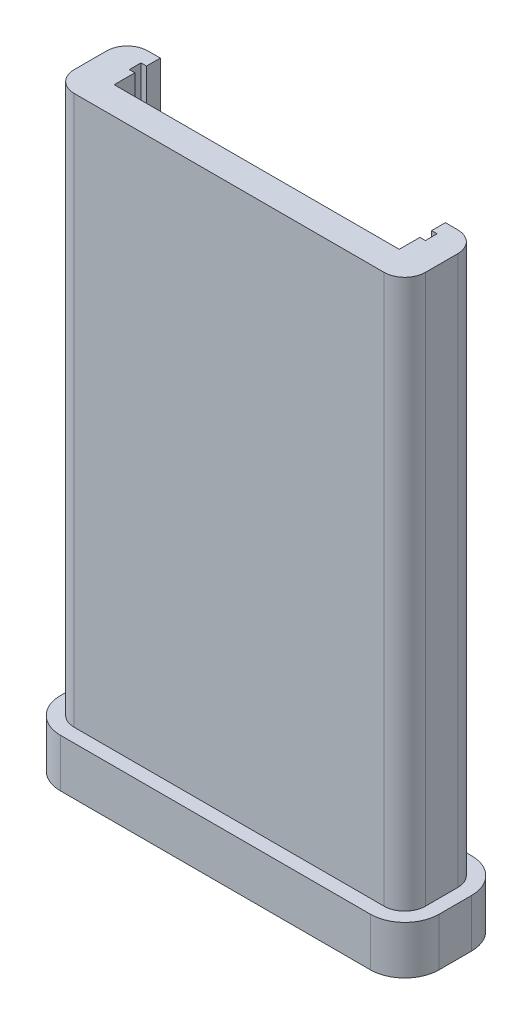
ISO-10303-21;
HEADER;
FILE_DESCRIPTION(('STEP AP214'),'2;1');
FILE_NAME('part.step','',(''),(''),'','','');
FILE_SCHEMA(('AUTOMOTIVE_DESIGN { 1 0 10303 214 1 1 1 1 }'));
ENDSEC;
DATA;
#1=APPLICATION_CONTEXT('core data for automotive mechanical design processes');
#2=APPLICATION_PROTOCOL_DEFINITION('international standard','automotive_design',2000,#1);
#3=PRODUCT_CONTEXT('',#1,'mechanical');
#4=PRODUCT('Part','Part','',(#3));
#5=PRODUCT_RELATED_PRODUCT_CATEGORY('part','',(#4));
#6=PRODUCT_DEFINITION_FORMATION('','',#4);
#7=PRODUCT_DEFINITION_CONTEXT('part definition',#1,'design');
#8=PRODUCT_DEFINITION('design','',#6,#7);
#9=PRODUCT_DEFINITION_SHAPE('','',#8);
#10=(LENGTH_UNIT() NAMED_UNIT(*) SI_UNIT(.MILLI.,.METRE.));
#11=(NAMED_UNIT(*) PLANE_ANGLE_UNIT() SI_UNIT($,.RADIAN.));
#12=(NAMED_UNIT(*) SI_UNIT($,.STERADIAN.) SOLID_ANGLE_UNIT());
#13=UNCERTAINTY_MEASURE_WITH_UNIT(LENGTH_MEASURE(1.E-05),#10,'distance_accuracy_value','');
#14=(GEOMETRIC_REPRESENTATION_CONTEXT(3) GLOBAL_UNCERTAINTY_ASSIGNED_CONTEXT((#13)) GLOBAL_UNIT_ASSIGNED_CONTEXT((#10,
#11,#12)) REPRESENTATION_CONTEXT('',''));
#15=CARTESIAN_POINT('',(0.,0.,0.));
#16=DIRECTION('',(0.,0.,1.));
#17=DIRECTION('',(1.,0.,0.));
#18=AXIS2_PLACEMENT_3D('',#15,#16,#17);
#19=CARTESIAN_POINT('',(0.,107.5944,-13.589));
#20=DIRECTION('',(0.,0.,-1.));
#21=DIRECTION('',(-1.,0.,0.));
#22=AXIS2_PLACEMENT_3D('',#19,#20,#21);
#23=PLANE('',#22);
#24=DIRECTION('',(-1.,0.,0.));
#25=VECTOR('',#24,1.);
#26=CARTESIAN_POINT('',(0.,6.34999999999999,-13.589));
#27=LINE('',#26,#25);
#28=CARTESIAN_POINT('',(71.755,6.34999999999999,-13.589));
#29=VERTEX_POINT('',#28);
#30=CARTESIAN_POINT('',(70.739,6.34999999999999,-13.589));
#31=VERTEX_POINT('',#30);
#32=EDGE_CURVE('E270',#29,#31,#27,.T.);
#33=ORIENTED_EDGE('',*,*,#32,.F.);
#34=DIRECTION('',(0.,-1.,0.));
#35=VECTOR('',#34,1.);
#36=CARTESIAN_POINT('',(71.755,107.5944,-13.589));
#37=LINE('',#36,#35);
#38=CARTESIAN_POINT('',(71.755,107.5944,-13.589));
#39=VERTEX_POINT('',#38);
#40=EDGE_CURVE('E372',#39,#29,#37,.T.);
#41=ORIENTED_EDGE('',*,*,#40,.F.);
#42=DIRECTION('',(1.,0.,0.));
#43=VECTOR('',#42,1.);
#44=CARTESIAN_POINT('',(0.,107.5944,-13.589));
#45=LINE('',#44,#43);
#46=CARTESIAN_POINT('',(70.739,107.5944,-13.589));
#47=VERTEX_POINT('',#46);
#48=EDGE_CURVE('E306',#47,#39,#45,.T.);
#49=ORIENTED_EDGE('',*,*,#48,.F.);
#50=DIRECTION('',(0.,-1.,0.));
#51=VECTOR('',#50,1.);
#52=CARTESIAN_POINT('',(70.739,107.5944,-13.589));
#53=LINE('',#52,#51);
#54=EDGE_CURVE('E339',#47,#31,#53,.T.);
#55=ORIENTED_EDGE('',*,*,#54,.T.);
#56=EDGE_LOOP('',(#33,#41,#49,#55));
#57=FACE_BOUND('',#56,.T.);
#58=ADVANCED_FACE('F39',(#57),#23,.F.);
#59=CARTESIAN_POINT('',(71.7550000000001,107.5944,-4.6123235949501E-13));
#60=DIRECTION('',(1.,0.,0.));
#61=DIRECTION('',(0.,0.,-1.));
#62=AXIS2_PLACEMENT_3D('',#59,#60,#61);
#63=PLANE('',#62);
#64=DIRECTION('',(0.,0.,-1.));
#65=VECTOR('',#64,1.);
#66=CARTESIAN_POINT('',(71.7550000000001,6.34999999999999,-4.6123235949501E-13));
#67=LINE('',#66,#65);
#68=CARTESIAN_POINT('',(71.755,6.34999999999999,-11.43));
#69=VERTEX_POINT('',#68);
#70=EDGE_CURVE('E277',#69,#29,#67,.T.);
#71=ORIENTED_EDGE('',*,*,#70,.F.);
#72=DIRECTION('',(0.,-1.,0.));
#73=VECTOR('',#72,1.);
#74=CARTESIAN_POINT('',(71.755,107.5944,-11.43));
#75=LINE('',#74,#73);
#76=CARTESIAN_POINT('',(71.755,107.5944,-11.43));
#77=VERTEX_POINT('',#76);
#78=EDGE_CURVE('E369',#77,#69,#75,.T.);
#79=ORIENTED_EDGE('',*,*,#78,.F.);
#80=DIRECTION('',(0.,0.,1.));
#81=VECTOR('',#80,1.);
#82=CARTESIAN_POINT('',(71.7550000000001,107.5944,-4.6123235949501E-13));
#83=LINE('',#82,#81);
#84=EDGE_CURVE('E309',#39,#77,#83,.T.);
#85=ORIENTED_EDGE('',*,*,#84,.F.);
#86=ORIENTED_EDGE('',*,*,#40,.T.);
#87=EDGE_LOOP('',(#71,#79,#85,#86));
#88=FACE_BOUND('',#87,.T.);
#89=ADVANCED_FACE('F469',(#88),#63,.F.);
#90=CARTESIAN_POINT('',(0.,107.5944,-11.43));
#91=DIRECTION('',(0.,0.,-1.));
#92=DIRECTION('',(-1.,0.,0.));
#93=AXIS2_PLACEMENT_3D('',#90,#91,#92);
#94=PLANE('',#93);
#95=ORIENTED_EDGE('',*,*,#78,.T.);
#96=DIRECTION('',(-1.,0.,0.));
#97=VECTOR('',#96,1.);
#98=CARTESIAN_POINT('',(0.,6.34999999999999,-11.43));
#99=LINE('',#98,#97);
#100=CARTESIAN_POINT('',(70.739,6.34999999999999,-11.43));
#101=VERTEX_POINT('',#100);
#102=EDGE_CURVE('E303',#69,#101,#99,.T.);
#103=ORIENTED_EDGE('',*,*,#102,.T.);
#104=DIRECTION('',(0.,-1.,0.));
#105=VECTOR('',#104,1.);
#106=CARTESIAN_POINT('',(70.739,107.5944,-11.43));
#107=LINE('',#106,#105);
#108=CARTESIAN_POINT('',(70.739,107.5944,-11.43));
#109=VERTEX_POINT('',#108);
#110=EDGE_CURVE('E366',#109,#101,#107,.T.);
#111=ORIENTED_EDGE('',*,*,#110,.F.);
#112=DIRECTION('',(1.,0.,0.));
#113=VECTOR('',#112,1.);
#114=CARTESIAN_POINT('',(0.,107.5944,-11.43));
#115=LINE('',#114,#113);
#116=EDGE_CURVE('E312',#109,#77,#115,.T.);
#117=ORIENTED_EDGE('',*,*,#116,.T.);
#118=EDGE_LOOP('',(#95,#103,#111,#117));
#119=FACE_BOUND('',#118,.T.);
#120=ADVANCED_FACE('F465',(#119),#94,.T.);
#121=CARTESIAN_POINT('',(70.739,107.5944,-1.1537205685004E-13));
#122=DIRECTION('',(-1.,0.,0.));
#123=DIRECTION('',(0.,0.,1.));
#124=AXIS2_PLACEMENT_3D('',#121,#122,#123);
#125=PLANE('',#124);
#126=ORIENTED_EDGE('',*,*,#110,.T.);
#127=DIRECTION('',(0.,0.,1.));
#128=VECTOR('',#127,1.);
#129=CARTESIAN_POINT('',(70.739,6.34999999999999,-1.1537205685004E-13));
#130=LINE('',#129,#128);
#131=CARTESIAN_POINT('',(70.739,6.34999999999999,-7.62));
#132=VERTEX_POINT('',#131);
#133=EDGE_CURVE('E300',#101,#132,#130,.T.);
#134=ORIENTED_EDGE('',*,*,#133,.T.);
#135=DIRECTION('',(0.,-1.,0.));
#136=VECTOR('',#135,1.);
#137=CARTESIAN_POINT('',(70.739,107.5944,-7.62));
#138=LINE('',#137,#136);
#139=CARTESIAN_POINT('',(70.739,107.5944,-7.62));
#140=VERTEX_POINT('',#139);
#141=EDGE_CURVE('E363',#140,#132,#138,.T.);
#142=ORIENTED_EDGE('',*,*,#141,.F.);
#143=DIRECTION('',(0.,0.,-1.));
#144=VECTOR('',#143,1.);
#145=CARTESIAN_POINT('',(70.739,107.5944,-1.1537205685004E-13));
#146=LINE('',#145,#144);
#147=EDGE_CURVE('E315',#140,#109,#146,.T.);
#148=ORIENTED_EDGE('',*,*,#147,.T.);
#149=EDGE_LOOP('',(#126,#134,#142,#148));
#150=FACE_BOUND('',#149,.T.);
#151=ADVANCED_FACE('F460',(#150),#125,.T.);
#152=CARTESIAN_POINT('',(0.,107.5944,-7.62));
#153=DIRECTION('',(0.,0.,-1.));
#154=DIRECTION('',(-1.,0.,0.));
#155=AXIS2_PLACEMENT_3D('',#152,#153,#154);
#156=PLANE('',#155);
#157=ORIENTED_EDGE('',*,*,#141,.T.);
#158=DIRECTION('',(-1.,0.,0.));
#159=VECTOR('',#158,1.);
#160=CARTESIAN_POINT('',(0.,6.34999999999999,-7.62));
#161=LINE('',#160,#159);
#162=CARTESIAN_POINT('',(18.161,6.34999999999999,-7.62));
#163=VERTEX_POINT('',#162);
#164=EDGE_CURVE('E297',#132,#163,#161,.T.);
#165=ORIENTED_EDGE('',*,*,#164,.T.);
#166=DIRECTION('',(0.,-1.,0.));
#167=VECTOR('',#166,1.);
#168=CARTESIAN_POINT('',(18.161,107.5944,-7.62));
#169=LINE('',#168,#167);
#170=CARTESIAN_POINT('',(18.161,107.5944,-7.62));
#171=VERTEX_POINT('',#170);
#172=EDGE_CURVE('E360',#171,#163,#169,.T.);
#173=ORIENTED_EDGE('',*,*,#172,.F.);
#174=DIRECTION('',(1.,0.,0.));
#175=VECTOR('',#174,1.);
#176=CARTESIAN_POINT('',(0.,107.5944,-7.62));
#177=LINE('',#176,#175);
#178=EDGE_CURVE('E319',#171,#140,#177,.T.);
#179=ORIENTED_EDGE('',*,*,#178,.T.);
#180=EDGE_LOOP('',(#157,#165,#173,#179));
#181=FACE_BOUND('',#180,.T.);
#182=ADVANCED_FACE('F457',(#181),#156,.T.);
#183=CARTESIAN_POINT('',(18.161,107.5944,0.));
#184=DIRECTION('',(-1.,0.,0.));
#185=DIRECTION('',(0.,0.,1.));
#186=AXIS2_PLACEMENT_3D('',#183,#184,#185);
#187=PLANE('',#186);
#188=DIRECTION('',(0.,0.,1.));
#189=VECTOR('',#188,1.);
#190=CARTESIAN_POINT('',(18.161,6.34999999999999,0.));
#191=LINE('',#190,#189);
#192=CARTESIAN_POINT('',(18.161,6.34999999999999,-11.43));
#193=VERTEX_POINT('',#192);
#194=EDGE_CURVE('E295',#193,#163,#191,.T.);
#195=ORIENTED_EDGE('',*,*,#194,.F.);
#196=DIRECTION('',(0.,-1.,0.));
#197=VECTOR('',#196,1.);
#198=CARTESIAN_POINT('',(18.161,107.5944,-11.43));
#199=LINE('',#198,#197);
#200=CARTESIAN_POINT('',(18.161,107.5944,-11.43));
#201=VERTEX_POINT('',#200);
#202=EDGE_CURVE('E357',#201,#193,#199,.T.);
#203=ORIENTED_EDGE('',*,*,#202,.F.);
#204=DIRECTION('',(0.,0.,-1.));
#205=VECTOR('',#204,1.);
#206=CARTESIAN_POINT('',(18.161,107.5944,0.));
#207=LINE('',#206,#205);
#208=EDGE_CURVE('E323',#171,#201,#207,.T.);
#209=ORIENTED_EDGE('',*,*,#208,.F.);
#210=ORIENTED_EDGE('',*,*,#172,.T.);
#211=EDGE_LOOP('',(#195,#203,#209,#210));
#212=FACE_BOUND('',#211,.T.);
#213=ADVANCED_FACE('F454',(#212),#187,.F.);
#214=ORIENTED_EDGE('',*,*,#202,.T.);
#215=DIRECTION('',(-1.,0.,0.));
#216=VECTOR('',#215,1.);
#217=CARTESIAN_POINT('',(0.,6.34999999999999,-11.43));
#218=LINE('',#217,#216);
#219=CARTESIAN_POINT('',(17.145,6.34999999999999,-11.43));
#220=VERTEX_POINT('',#219);
#221=EDGE_CURVE('E292',#193,#220,#218,.T.);
#222=ORIENTED_EDGE('',*,*,#221,.T.);
#223=DIRECTION('',(0.,-1.,0.));
#224=VECTOR('',#223,1.);
#225=CARTESIAN_POINT('',(17.145,107.5944,-11.43));
#226=LINE('',#225,#224);
#227=CARTESIAN_POINT('',(17.145,107.5944,-11.43));
#228=VERTEX_POINT('',#227);
#229=EDGE_CURVE('E354',#228,#220,#226,.T.);
#230=ORIENTED_EDGE('',*,*,#229,.F.);
#231=EDGE_CURVE('E316',#228,#201,#115,.T.);
#232=ORIENTED_EDGE('',*,*,#231,.T.);
#233=EDGE_LOOP('',(#214,#222,#230,#232));
#234=FACE_BOUND('',#233,.T.);
#235=ADVANCED_FACE('F448',(#234),#94,.T.);
#236=CARTESIAN_POINT('',(17.145,107.5944,0.));
#237=DIRECTION('',(1.,0.,0.));
#238=DIRECTION('',(0.,0.,-1.));
#239=AXIS2_PLACEMENT_3D('',#236,#237,#238);
#240=PLANE('',#239);
#241=ORIENTED_EDGE('',*,*,#229,.T.);
#242=DIRECTION('',(0.,0.,-1.));
#243=VECTOR('',#242,1.);
#244=CARTESIAN_POINT('',(17.145,6.34999999999999,0.));
#245=LINE('',#244,#243);
#246=CARTESIAN_POINT('',(17.145,6.34999999999999,-13.589));
#247=VERTEX_POINT('',#246);
#248=EDGE_CURVE('E289',#220,#247,#245,.T.);
#249=ORIENTED_EDGE('',*,*,#248,.T.);
#250=DIRECTION('',(0.,-1.,0.));
#251=VECTOR('',#250,1.);
#252=CARTESIAN_POINT('',(17.145,107.5944,-13.589));
#253=LINE('',#252,#251);
#254=CARTESIAN_POINT('',(17.145,107.5944,-13.589));
#255=VERTEX_POINT('',#254);
#256=EDGE_CURVE('E351',#255,#247,#253,.T.);
#257=ORIENTED_EDGE('',*,*,#256,.F.);
#258=DIRECTION('',(0.,0.,1.));
#259=VECTOR('',#258,1.);
#260=CARTESIAN_POINT('',(17.145,107.5944,0.));
#261=LINE('',#260,#259);
#262=EDGE_CURVE('E326',#255,#228,#261,.T.);
#263=ORIENTED_EDGE('',*,*,#262,.T.);
#264=EDGE_LOOP('',(#241,#249,#257,#263));
#265=FACE_BOUND('',#264,.T.);
#266=ADVANCED_FACE('F445',(#265),#240,.T.);
#267=DIRECTION('',(-1.,0.,0.));
#268=VECTOR('',#267,1.);
#269=CARTESIAN_POINT('',(0.,6.34999999999999,-13.589));
#270=LINE('',#269,#268);
#271=CARTESIAN_POINT('',(18.161,6.34999999999999,-13.589));
#272=VERTEX_POINT('',#271);
#273=EDGE_CURVE('E287',#272,#247,#270,.T.);
#274=ORIENTED_EDGE('',*,*,#273,.F.);
#275=DIRECTION('',(0.,-1.,0.));
#276=VECTOR('',#275,1.);
#277=CARTESIAN_POINT('',(18.161,107.5944,-13.589));
#278=LINE('',#277,#276);
#279=CARTESIAN_POINT('',(18.161,107.5944,-13.589));
#280=VERTEX_POINT('',#279);
#281=EDGE_CURVE('E348',#280,#272,#278,.T.);
#282=ORIENTED_EDGE('',*,*,#281,.F.);
#283=EDGE_CURVE('E310',#255,#280,#45,.T.);
#284=ORIENTED_EDGE('',*,*,#283,.F.);
#285=ORIENTED_EDGE('',*,*,#256,.T.);
#286=EDGE_LOOP('',(#274,#282,#284,#285));
#287=FACE_BOUND('',#286,.T.);
#288=ADVANCED_FACE('F441',(#287),#23,.F.);
#289=DIRECTION('',(0.,0.,1.));
#290=VECTOR('',#289,1.);
#291=CARTESIAN_POINT('',(18.161,6.34999999999999,0.));
#292=LINE('',#291,#290);
#293=CARTESIAN_POINT('',(18.161,6.34999999999999,-16.129));
#294=VERTEX_POINT('',#293);
#295=EDGE_CURVE('E285',#294,#272,#292,.T.);
#296=ORIENTED_EDGE('',*,*,#295,.F.);
#297=DIRECTION('',(0.,-1.,0.));
#298=VECTOR('',#297,1.);
#299=CARTESIAN_POINT('',(18.161,107.5944,-16.129));
#300=LINE('',#299,#298);
#301=CARTESIAN_POINT('',(18.161,107.5944,-16.129));
#302=VERTEX_POINT('',#301);
#303=EDGE_CURVE('E345',#302,#294,#300,.T.);
#304=ORIENTED_EDGE('',*,*,#303,.F.);
#305=EDGE_CURVE('E325',#280,#302,#207,.T.);
#306=ORIENTED_EDGE('',*,*,#305,.F.);
#307=ORIENTED_EDGE('',*,*,#281,.T.);
#308=EDGE_LOOP('',(#296,#304,#306,#307));
#309=FACE_BOUND('',#308,.T.);
#310=ADVANCED_FACE('F437',(#309),#187,.F.);
#311=CARTESIAN_POINT('',(0.,107.5944,-16.129));
#312=DIRECTION('',(0.,0.,-1.));
#313=DIRECTION('',(-1.,0.,0.));
#314=AXIS2_PLACEMENT_3D('',#311,#312,#313);
#315=PLANE('',#314);
#316=ORIENTED_EDGE('',*,*,#303,.T.);
#317=DIRECTION('',(-1.,0.,0.));
#318=VECTOR('',#317,1.);
#319=CARTESIAN_POINT('',(0.,6.34999999999999,-16.129));
#320=LINE('',#319,#318);
#321=CARTESIAN_POINT('',(15.875,6.34999999999999,-16.129));
#322=VERTEX_POINT('',#321);
#323=EDGE_CURVE('E282',#294,#322,#320,.T.);
#324=ORIENTED_EDGE('',*,*,#323,.T.);
#325=DIRECTION('',(0.,-1.,0.));
#326=VECTOR('',#325,1.);
#327=CARTESIAN_POINT('',(15.875,107.5944,-16.129));
#328=LINE('',#327,#326);
#329=CARTESIAN_POINT('',(15.875,107.5944,-16.129));
#330=VERTEX_POINT('',#329);
#331=EDGE_CURVE('E391',#322,#330,#328,.F.);
#332=ORIENTED_EDGE('',*,*,#331,.T.);
#333=DIRECTION('',(1.,0.,0.));
#334=VECTOR('',#333,1.);
#335=CARTESIAN_POINT('',(0.,107.5944,-16.129));
#336=LINE('',#335,#334);
#337=EDGE_CURVE('E329',#330,#302,#336,.T.);
#338=ORIENTED_EDGE('',*,*,#337,.T.);
#339=EDGE_LOOP('',(#316,#324,#332,#338));
#340=FACE_BOUND('',#339,.T.);
#341=ADVANCED_FACE('F431',(#340),#315,.T.);
#342=CARTESIAN_POINT('',(12.065,107.5944,0.));
#343=DIRECTION('',(1.,0.,0.));
#344=DIRECTION('',(0.,0.,-1.));
#345=AXIS2_PLACEMENT_3D('',#342,#343,#344);
#346=PLANE('',#345);
#347=DIRECTION('',(0.,0.,-1.));
#348=VECTOR('',#347,1.);
#349=CARTESIAN_POINT('',(12.065,6.34999999999999,0.));
#350=LINE('',#349,#348);
#351=CARTESIAN_POINT('',(12.065,6.34999999999999,-6.35));
#352=VERTEX_POINT('',#351);
#353=CARTESIAN_POINT('',(12.065,6.34999999999999,-12.319));
#354=VERTEX_POINT('',#353);
#355=EDGE_CURVE('E275',#352,#354,#350,.T.);
#356=ORIENTED_EDGE('',*,*,#355,.F.);
#357=DIRECTION('',(0.,-1.,0.));
#358=VECTOR('',#357,1.);
#359=CARTESIAN_POINT('',(12.065,107.5944,-6.35));
#360=LINE('',#359,#358);
#361=CARTESIAN_POINT('',(12.065,107.5944,-6.35));
#362=VERTEX_POINT('',#361);
#363=EDGE_CURVE('E383',#352,#362,#360,.F.);
#364=ORIENTED_EDGE('',*,*,#363,.T.);
#365=DIRECTION('',(0.,0.,1.));
#366=VECTOR('',#365,1.);
#367=CARTESIAN_POINT('',(12.065,107.5944,0.));
#368=LINE('',#367,#366);
#369=CARTESIAN_POINT('',(12.065,107.5944,-12.319));
#370=VERTEX_POINT('',#369);
#371=EDGE_CURVE('E331',#370,#362,#368,.T.);
#372=ORIENTED_EDGE('',*,*,#371,.F.);
#373=DIRECTION('',(0.,-1.,0.));
#374=VECTOR('',#373,1.);
#375=CARTESIAN_POINT('',(12.065,5.9944,-12.319));
#376=LINE('',#375,#374);
#377=EDGE_CURVE('E380',#370,#354,#376,.T.);
#378=ORIENTED_EDGE('',*,*,#377,.T.);
#379=EDGE_LOOP('',(#356,#364,#372,#378));
#380=FACE_BOUND('',#379,.T.);
#381=ADVANCED_FACE('F422',(#380),#346,.F.);
#382=CARTESIAN_POINT('',(0.,107.5944,-2.54));
#383=DIRECTION('',(0.,0.,-1.));
#384=DIRECTION('',(-1.,0.,0.));
#385=AXIS2_PLACEMENT_3D('',#382,#383,#384);
#386=PLANE('',#385);
#387=DIRECTION('',(-1.,0.,0.));
#388=VECTOR('',#387,1.);
#389=CARTESIAN_POINT('',(0.,6.34999999999999,-2.54));
#390=LINE('',#389,#388);
#391=CARTESIAN_POINT('',(73.025,6.34999999999999,-2.54));
#392=VERTEX_POINT('',#391);
#393=CARTESIAN_POINT('',(15.875,6.34999999999999,-2.54));
#394=VERTEX_POINT('',#393);
#395=EDGE_CURVE('E268',#392,#394,#390,.T.);
#396=ORIENTED_EDGE('',*,*,#395,.F.);
#397=DIRECTION('',(0.,-1.,0.));
#398=VECTOR('',#397,1.);
#399=CARTESIAN_POINT('',(73.025,107.5944,-2.54));
#400=LINE('',#399,#398);
#401=CARTESIAN_POINT('',(73.025,107.5944,-2.54));
#402=VERTEX_POINT('',#401);
#403=EDGE_CURVE('E375',#392,#402,#400,.F.);
#404=ORIENTED_EDGE('',*,*,#403,.T.);
#405=DIRECTION('',(1.,0.,0.));
#406=VECTOR('',#405,1.);
#407=CARTESIAN_POINT('',(0.,107.5944,-2.54));
#408=LINE('',#407,#406);
#409=CARTESIAN_POINT('',(15.875,107.5944,-2.54));
#410=VERTEX_POINT('',#409);
#411=EDGE_CURVE('E335',#410,#402,#408,.T.);
#412=ORIENTED_EDGE('',*,*,#411,.F.);
#413=DIRECTION('',(0.,-1.,0.));
#414=VECTOR('',#413,1.);
#415=CARTESIAN_POINT('',(15.875,107.5944,-2.54));
#416=LINE('',#415,#414);
#417=EDGE_CURVE('E377',#410,#394,#416,.T.);
#418=ORIENTED_EDGE('',*,*,#417,.T.);
#419=EDGE_LOOP('',(#396,#404,#412,#418));
#420=FACE_BOUND('',#419,.T.);
#421=ADVANCED_FACE('F413',(#420),#386,.F.);
#422=CARTESIAN_POINT('',(76.835,107.5944,0.));
#423=DIRECTION('',(1.,0.,0.));
#424=DIRECTION('',(0.,0.,-1.));
#425=AXIS2_PLACEMENT_3D('',#422,#423,#424);
#426=PLANE('',#425);
#427=DIRECTION('',(0.,-1.,0.));
#428=VECTOR('',#427,1.);
#429=CARTESIAN_POINT('',(76.835,5.9944,-6.35));
#430=LINE('',#429,#428);
#431=CARTESIAN_POINT('',(76.835,107.5944,-6.35));
#432=VERTEX_POINT('',#431);
#433=CARTESIAN_POINT('',(76.835,6.34999999999999,-6.35));
#434=VERTEX_POINT('',#433);
#435=EDGE_CURVE('E395',#432,#434,#430,.T.);
#436=ORIENTED_EDGE('',*,*,#435,.T.);
#437=DIRECTION('',(0.,0.,-1.));
#438=VECTOR('',#437,1.);
#439=CARTESIAN_POINT('',(76.835,6.34999999999999,0.));
#440=LINE('',#439,#438);
#441=CARTESIAN_POINT('',(76.835,6.34999999999999,-12.319));
#442=VERTEX_POINT('',#441);
#443=EDGE_CURVE('E254',#434,#442,#440,.T.);
#444=ORIENTED_EDGE('',*,*,#443,.T.);
#445=DIRECTION('',(0.,-1.,0.));
#446=VECTOR('',#445,1.);
#447=CARTESIAN_POINT('',(76.835,107.5944,-12.319));
#448=LINE('',#447,#446);
#449=CARTESIAN_POINT('',(76.835,107.5944,-12.319));
#450=VERTEX_POINT('',#449);
#451=EDGE_CURVE('E393',#442,#450,#448,.F.);
#452=ORIENTED_EDGE('',*,*,#451,.T.);
#453=DIRECTION('',(0.,0.,1.));
#454=VECTOR('',#453,1.);
#455=CARTESIAN_POINT('',(76.835,107.5944,0.));
#456=LINE('',#455,#454);
#457=EDGE_CURVE('E337',#450,#432,#456,.T.);
#458=ORIENTED_EDGE('',*,*,#457,.T.);
#459=EDGE_LOOP('',(#436,#444,#452,#458));
#460=FACE_BOUND('',#459,.T.);
#461=ADVANCED_FACE('F406',(#460),#426,.T.);
#462=DIRECTION('',(0.,-1.,0.));
#463=VECTOR('',#462,1.);
#464=CARTESIAN_POINT('',(73.025,107.5944,-16.129));
#465=LINE('',#464,#463);
#466=CARTESIAN_POINT('',(73.025,107.5944,-16.129));
#467=VERTEX_POINT('',#466);
#468=CARTESIAN_POINT('',(73.025,6.34999999999999,-16.129));
#469=VERTEX_POINT('',#468);
#470=EDGE_CURVE('E47',#467,#469,#465,.T.);
#471=ORIENTED_EDGE('',*,*,#470,.T.);
#472=DIRECTION('',(-1.,0.,0.));
#473=VECTOR('',#472,1.);
#474=CARTESIAN_POINT('',(0.,6.34999999999999,-16.129));
#475=LINE('',#474,#473);
#476=CARTESIAN_POINT('',(70.739,6.34999999999999,-16.129));
#477=VERTEX_POINT('',#476);
#478=EDGE_CURVE('E251',#469,#477,#475,.T.);
#479=ORIENTED_EDGE('',*,*,#478,.T.);
#480=DIRECTION('',(0.,-1.,0.));
#481=VECTOR('',#480,1.);
#482=CARTESIAN_POINT('',(70.739,107.5944,-16.129));
#483=LINE('',#482,#481);
#484=CARTESIAN_POINT('',(70.739,107.5944,-16.129));
#485=VERTEX_POINT('',#484);
#486=EDGE_CURVE('E342',#485,#477,#483,.T.);
#487=ORIENTED_EDGE('',*,*,#486,.F.);
#488=EDGE_CURVE('E332',#485,#467,#336,.T.);
#489=ORIENTED_EDGE('',*,*,#488,.T.);
#490=EDGE_LOOP('',(#471,#479,#487,#489));
#491=FACE_BOUND('',#490,.T.);
#492=ADVANCED_FACE('F400',(#491),#315,.T.);
#493=ORIENTED_EDGE('',*,*,#486,.T.);
#494=DIRECTION('',(0.,0.,1.));
#495=VECTOR('',#494,1.);
#496=CARTESIAN_POINT('',(70.739,6.34999999999999,-1.1537205685004E-13));
#497=LINE('',#496,#495);
#498=EDGE_CURVE('E265',#477,#31,#497,.T.);
#499=ORIENTED_EDGE('',*,*,#498,.T.);
#500=ORIENTED_EDGE('',*,*,#54,.F.);
#501=EDGE_CURVE('E320',#47,#485,#146,.T.);
#502=ORIENTED_EDGE('',*,*,#501,.T.);
#503=EDGE_LOOP('',(#493,#499,#500,#502));
#504=FACE_BOUND('',#503,.T.);
#505=ADVANCED_FACE('F475',(#504),#125,.T.);
#506=CARTESIAN_POINT('',(15.875,107.5944,-6.35));
#507=DIRECTION('',(0.,-1.,0.));
#508=DIRECTION('',(0.,0.,-1.));
#509=AXIS2_PLACEMENT_3D('',#506,#507,#508);
#510=CYLINDRICAL_SURFACE('',#509,3.81);
#511=ORIENTED_EDGE('',*,*,#363,.F.);
#512=CARTESIAN_POINT('',(15.875,6.34999999999999,-6.35));
#513=DIRECTION('',(0.,-1.,0.));
#514=DIRECTION('',(0.,0.,-1.));
#515=AXIS2_PLACEMENT_3D('',#512,#513,#514);
#516=CIRCLE('',#515,3.81);
#517=EDGE_CURVE('E272',#352,#394,#516,.F.);
#518=ORIENTED_EDGE('',*,*,#517,.T.);
#519=ORIENTED_EDGE('',*,*,#417,.F.);
#520=CARTESIAN_POINT('',(15.875,107.5944,-6.35));
#521=DIRECTION('',(0.,1.,0.));
#522=DIRECTION('',(0.,0.,1.));
#523=AXIS2_PLACEMENT_3D('',#520,#521,#522);
#524=CIRCLE('',#523,3.81);
#525=EDGE_CURVE('E389',#362,#410,#524,.T.);
#526=ORIENTED_EDGE('',*,*,#525,.F.);
#527=EDGE_LOOP('',(#511,#518,#519,#526));
#528=FACE_BOUND('',#527,.T.);
#529=ADVANCED_FACE('F419',(#528),#510,.T.);
#530=CARTESIAN_POINT('',(15.875,107.5944,-12.319));
#531=DIRECTION('',(0.,1.,0.));
#532=DIRECTION('',(0.,0.,1.));
#533=AXIS2_PLACEMENT_3D('',#530,#531,#532);
#534=CYLINDRICAL_SURFACE('',#533,3.81);
#535=ORIENTED_EDGE('',*,*,#331,.F.);
#536=CARTESIAN_POINT('',(15.875,6.34999999999999,-12.319));
#537=DIRECTION('',(0.,-1.,0.));
#538=DIRECTION('',(0.,0.,-1.));
#539=AXIS2_PLACEMENT_3D('',#536,#537,#538);
#540=CIRCLE('',#539,3.81);
#541=EDGE_CURVE('E279',#322,#354,#540,.F.);
#542=ORIENTED_EDGE('',*,*,#541,.T.);
#543=ORIENTED_EDGE('',*,*,#377,.F.);
#544=CARTESIAN_POINT('',(15.875,107.5944,-12.319));
#545=DIRECTION('',(0.,1.,0.));
#546=DIRECTION('',(0.,0.,1.));
#547=AXIS2_PLACEMENT_3D('',#544,#545,#546);
#548=CIRCLE('',#547,3.81);
#549=EDGE_CURVE('E387',#330,#370,#548,.T.);
#550=ORIENTED_EDGE('',*,*,#549,.F.);
#551=EDGE_LOOP('',(#535,#542,#543,#550));
#552=FACE_BOUND('',#551,.T.);
#553=ADVANCED_FACE('F428',(#552),#534,.T.);
#554=CARTESIAN_POINT('',(73.025,107.5944,-6.35));
#555=DIRECTION('',(0.,1.,0.));
#556=DIRECTION('',(0.,0.,1.));
#557=AXIS2_PLACEMENT_3D('',#554,#555,#556);
#558=CYLINDRICAL_SURFACE('',#557,3.81);
#559=ORIENTED_EDGE('',*,*,#403,.F.);
#560=CARTESIAN_POINT('',(73.025,6.34999999999999,-6.35));
#561=DIRECTION('',(0.,-1.,0.));
#562=DIRECTION('',(0.,0.,-1.));
#563=AXIS2_PLACEMENT_3D('',#560,#561,#562);
#564=CIRCLE('',#563,3.81);
#565=EDGE_CURVE('E262',#392,#434,#564,.F.);
#566=ORIENTED_EDGE('',*,*,#565,.T.);
#567=ORIENTED_EDGE('',*,*,#435,.F.);
#568=CARTESIAN_POINT('',(73.025,107.5944,-6.35));
#569=DIRECTION('',(0.,1.,0.));
#570=DIRECTION('',(0.,0.,1.));
#571=AXIS2_PLACEMENT_3D('',#568,#569,#570);
#572=CIRCLE('',#571,3.81);
#573=EDGE_CURVE('E60',#402,#432,#572,.T.);
#574=ORIENTED_EDGE('',*,*,#573,.F.);
#575=EDGE_LOOP('',(#559,#566,#567,#574));
#576=FACE_BOUND('',#575,.T.);
#577=ADVANCED_FACE('F410',(#576),#558,.T.);
#578=CARTESIAN_POINT('',(73.025,107.5944,-12.319));
#579=DIRECTION('',(0.,-1.,0.));
#580=DIRECTION('',(0.,0.,-1.));
#581=AXIS2_PLACEMENT_3D('',#578,#579,#580);
#582=CYLINDRICAL_SURFACE('',#581,3.81);
#583=ORIENTED_EDGE('',*,*,#451,.F.);
#584=CARTESIAN_POINT('',(73.025,6.34999999999999,-12.319));
#585=DIRECTION('',(0.,-1.,0.));
#586=DIRECTION('',(0.,0.,-1.));
#587=AXIS2_PLACEMENT_3D('',#584,#585,#586);
#588=CIRCLE('',#587,3.81);
#589=EDGE_CURVE('E11',#442,#469,#588,.F.);
#590=ORIENTED_EDGE('',*,*,#589,.T.);
#591=ORIENTED_EDGE('',*,*,#470,.F.);
#592=CARTESIAN_POINT('',(73.025,107.5944,-12.319));
#593=DIRECTION('',(0.,1.,0.));
#594=DIRECTION('',(0.,0.,1.));
#595=AXIS2_PLACEMENT_3D('',#592,#593,#594);
#596=CIRCLE('',#595,3.81);
#597=EDGE_CURVE('E54',#450,#467,#596,.T.);
#598=ORIENTED_EDGE('',*,*,#597,.F.);
#599=EDGE_LOOP('',(#583,#590,#591,#598));
#600=FACE_BOUND('',#599,.T.);
#601=ADVANCED_FACE('F41',(#600),#582,.T.);
#602=CARTESIAN_POINT('',(0.,107.5944,0.));
#603=DIRECTION('',(0.,1.,0.));
#604=DIRECTION('',(0.,0.,1.));
#605=AXIS2_PLACEMENT_3D('',#602,#603,#604);
#606=PLANE('',#605);
#607=ORIENTED_EDGE('',*,*,#371,.T.);
#608=ORIENTED_EDGE('',*,*,#525,.T.);
#609=ORIENTED_EDGE('',*,*,#411,.T.);
#610=ORIENTED_EDGE('',*,*,#573,.T.);
#611=ORIENTED_EDGE('',*,*,#457,.F.);
#612=ORIENTED_EDGE('',*,*,#597,.T.);
#613=ORIENTED_EDGE('',*,*,#488,.F.);
#614=ORIENTED_EDGE('',*,*,#501,.F.);
#615=ORIENTED_EDGE('',*,*,#48,.T.);
#616=ORIENTED_EDGE('',*,*,#84,.T.);
#617=ORIENTED_EDGE('',*,*,#116,.F.);
#618=ORIENTED_EDGE('',*,*,#147,.F.);
#619=ORIENTED_EDGE('',*,*,#178,.F.);
#620=ORIENTED_EDGE('',*,*,#208,.T.);
#621=ORIENTED_EDGE('',*,*,#231,.F.);
#622=ORIENTED_EDGE('',*,*,#262,.F.);
#623=ORIENTED_EDGE('',*,*,#283,.T.);
#624=ORIENTED_EDGE('',*,*,#305,.T.);
#625=ORIENTED_EDGE('',*,*,#337,.F.);
#626=ORIENTED_EDGE('',*,*,#549,.T.);
#627=EDGE_LOOP('',(#607,#608,#609,#610,#611,#612,#613,#614,#615,#616,#617,#618,#619,#620,#621,
#622,#623,#624,#625,#626));
#628=FACE_BOUND('',#627,.T.);
#629=ADVANCED_FACE('F462',(#628),#606,.T.);
#630=CARTESIAN_POINT('',(0.,6.35,0.));
#631=DIRECTION('',(0.,-1.,0.));
#632=DIRECTION('',(0.,0.,-1.));
#633=AXIS2_PLACEMENT_3D('',#630,#631,#632);
#634=PLANE('',#633);
#635=DIRECTION('',(0.,0.,-1.));
#636=VECTOR('',#635,1.);
#637=CARTESIAN_POINT('',(9.525,6.35,0.));
#638=LINE('',#637,#636);
#639=CARTESIAN_POINT('',(9.525,6.35,-6.35));
#640=VERTEX_POINT('',#639);
#641=CARTESIAN_POINT('',(9.525,6.35,-12.319));
#642=VERTEX_POINT('',#641);
#643=EDGE_CURVE('E250',#640,#642,#638,.T.);
#644=ORIENTED_EDGE('',*,*,#643,.F.);
#645=CARTESIAN_POINT('',(15.875,6.35,-6.35));
#646=DIRECTION('',(0.,-1.,0.));
#647=DIRECTION('',(0.,0.,-1.));
#648=AXIS2_PLACEMENT_3D('',#645,#646,#647);
#649=CIRCLE('',#648,6.34999999999999);
#650=CARTESIAN_POINT('',(15.875,6.35,0.));
#651=VERTEX_POINT('',#650);
#652=EDGE_CURVE('E246',#651,#640,#649,.T.);
#653=ORIENTED_EDGE('',*,*,#652,.F.);
#654=DIRECTION('',(-1.,0.,0.));
#655=VECTOR('',#654,1.);
#656=CARTESIAN_POINT('',(0.,6.35,0.));
#657=LINE('',#656,#655);
#658=CARTESIAN_POINT('',(73.025,6.35,0.));
#659=VERTEX_POINT('',#658);
#660=EDGE_CURVE('E606',#659,#651,#657,.T.);
#661=ORIENTED_EDGE('',*,*,#660,.F.);
#662=CARTESIAN_POINT('',(73.025,6.35,-6.35));
#663=DIRECTION('',(0.,-1.,0.));
#664=DIRECTION('',(0.,0.,-1.));
#665=AXIS2_PLACEMENT_3D('',#662,#663,#664);
#666=CIRCLE('',#665,6.35);
#667=CARTESIAN_POINT('',(79.375,6.35,-6.35));
#668=VERTEX_POINT('',#667);
#669=EDGE_CURVE('E604',#668,#659,#666,.T.);
#670=ORIENTED_EDGE('',*,*,#669,.F.);
#671=DIRECTION('',(0.,0.,1.));
#672=VECTOR('',#671,1.);
#673=CARTESIAN_POINT('',(79.375,6.35,0.));
#674=LINE('',#673,#672);
#675=CARTESIAN_POINT('',(79.375,6.35,-12.319));
#676=VERTEX_POINT('',#675);
#677=EDGE_CURVE('E602',#676,#668,#674,.T.);
#678=ORIENTED_EDGE('',*,*,#677,.F.);
#679=CARTESIAN_POINT('',(73.025,6.35,-12.319));
#680=DIRECTION('',(0.,-1.,0.));
#681=DIRECTION('',(0.,0.,-1.));
#682=AXIS2_PLACEMENT_3D('',#679,#680,#681);
#683=CIRCLE('',#682,6.35);
#684=CARTESIAN_POINT('',(73.025,6.35,-18.669));
#685=VERTEX_POINT('',#684);
#686=EDGE_CURVE('E600',#685,#676,#683,.T.);
#687=ORIENTED_EDGE('',*,*,#686,.F.);
#688=DIRECTION('',(1.,0.,0.));
#689=VECTOR('',#688,1.);
#690=CARTESIAN_POINT('',(0.,6.35,-18.669));
#691=LINE('',#690,#689);
#692=CARTESIAN_POINT('',(15.875,6.35,-18.669));
#693=VERTEX_POINT('',#692);
#694=EDGE_CURVE('E598',#693,#685,#691,.T.);
#695=ORIENTED_EDGE('',*,*,#694,.F.);
#696=CARTESIAN_POINT('',(15.875,6.35,-12.319));
#697=DIRECTION('',(0.,-1.,0.));
#698=DIRECTION('',(0.,0.,-1.));
#699=AXIS2_PLACEMENT_3D('',#696,#697,#698);
#700=CIRCLE('',#699,6.35);
#701=EDGE_CURVE('E575',#642,#693,#700,.T.);
#702=ORIENTED_EDGE('',*,*,#701,.F.);
#703=EDGE_LOOP('',(#644,#653,#661,#670,#678,#687,#695,#702));
#704=FACE_BOUND('',#703,.T.);
#705=ORIENTED_EDGE('',*,*,#102,.F.);
#706=ORIENTED_EDGE('',*,*,#70,.T.);
#707=ORIENTED_EDGE('',*,*,#32,.T.);
#708=ORIENTED_EDGE('',*,*,#498,.F.);
#709=ORIENTED_EDGE('',*,*,#478,.F.);
#710=ORIENTED_EDGE('',*,*,#589,.F.);
#711=ORIENTED_EDGE('',*,*,#443,.F.);
#712=ORIENTED_EDGE('',*,*,#565,.F.);
#713=ORIENTED_EDGE('',*,*,#395,.T.);
#714=ORIENTED_EDGE('',*,*,#517,.F.);
#715=ORIENTED_EDGE('',*,*,#355,.T.);
#716=ORIENTED_EDGE('',*,*,#541,.F.);
#717=ORIENTED_EDGE('',*,*,#323,.F.);
#718=ORIENTED_EDGE('',*,*,#295,.T.);
#719=ORIENTED_EDGE('',*,*,#273,.T.);
#720=ORIENTED_EDGE('',*,*,#248,.F.);
#721=ORIENTED_EDGE('',*,*,#221,.F.);
#722=ORIENTED_EDGE('',*,*,#194,.T.);
#723=ORIENTED_EDGE('',*,*,#164,.F.);
#724=ORIENTED_EDGE('',*,*,#133,.F.);
#725=EDGE_LOOP('',(#705,#706,#707,#708,#709,#710,#711,#712,#713,#714,#715,#716,#717,#718,#719,
#720,#721,#722,#723,#724));
#726=FACE_BOUND('',#725,.T.);
#727=ADVANCED_FACE('F404',(#704,#726),#634,.F.);
#728=CARTESIAN_POINT('',(9.525,-2.54,0.));
#729=DIRECTION('',(1.,0.,0.));
#730=DIRECTION('',(0.,0.,-1.));
#731=AXIS2_PLACEMENT_3D('',#728,#729,#730);
#732=PLANE('',#731);
#733=ORIENTED_EDGE('',*,*,#643,.T.);
#734=DIRECTION('',(0.,1.,0.));
#735=VECTOR('',#734,1.);
#736=CARTESIAN_POINT('',(9.525,-2.54,-12.319));
#737=LINE('',#736,#735);
#738=CARTESIAN_POINT('',(9.525,-2.54,-12.319));
#739=VERTEX_POINT('',#738);
#740=EDGE_CURVE('E230',#739,#642,#737,.T.);
#741=ORIENTED_EDGE('',*,*,#740,.F.);
#742=DIRECTION('',(0.,0.,-1.));
#743=VECTOR('',#742,1.);
#744=CARTESIAN_POINT('',(9.525,-2.54,0.));
#745=LINE('',#744,#743);
#746=CARTESIAN_POINT('',(9.525,-2.54,-6.35));
#747=VERTEX_POINT('',#746);
#748=EDGE_CURVE('E237',#747,#739,#745,.T.);
#749=ORIENTED_EDGE('',*,*,#748,.F.);
#750=DIRECTION('',(0.,1.,0.));
#751=VECTOR('',#750,1.);
#752=CARTESIAN_POINT('',(9.525,-2.54,-6.35));
#753=LINE('',#752,#751);
#754=EDGE_CURVE('E595',#747,#640,#753,.T.);
#755=ORIENTED_EDGE('',*,*,#754,.T.);
#756=EDGE_LOOP('',(#733,#741,#749,#755));
#757=FACE_BOUND('',#756,.T.);
#758=ADVANCED_FACE('F248',(#757),#732,.F.);
#759=CARTESIAN_POINT('',(15.875,-2.54,-12.319));
#760=DIRECTION('',(0.,1.,0.));
#761=DIRECTION('',(0.,0.,1.));
#762=AXIS2_PLACEMENT_3D('',#759,#760,#761);
#763=CYLINDRICAL_SURFACE('',#762,6.35);
#764=ORIENTED_EDGE('',*,*,#701,.T.);
#765=DIRECTION('',(0.,1.,0.));
#766=VECTOR('',#765,1.);
#767=CARTESIAN_POINT('',(15.875,-2.54,-18.669));
#768=LINE('',#767,#766);
#769=CARTESIAN_POINT('',(15.875,-2.54,-18.669));
#770=VERTEX_POINT('',#769);
#771=EDGE_CURVE('E233',#770,#693,#768,.T.);
#772=ORIENTED_EDGE('',*,*,#771,.F.);
#773=CARTESIAN_POINT('',(15.875,-2.54,-12.319));
#774=DIRECTION('',(0.,-1.,0.));
#775=DIRECTION('',(0.,0.,-1.));
#776=AXIS2_PLACEMENT_3D('',#773,#774,#775);
#777=CIRCLE('',#776,6.35);
#778=EDGE_CURVE('E226',#739,#770,#777,.T.);
#779=ORIENTED_EDGE('',*,*,#778,.F.);
#780=ORIENTED_EDGE('',*,*,#740,.T.);
#781=EDGE_LOOP('',(#764,#772,#779,#780));
#782=FACE_BOUND('',#781,.T.);
#783=ADVANCED_FACE('F228',(#782),#763,.T.);
#784=CARTESIAN_POINT('',(0.,-2.54,-18.669));
#785=DIRECTION('',(0.,0.,1.));
#786=DIRECTION('',(1.,0.,0.));
#787=AXIS2_PLACEMENT_3D('',#784,#785,#786);
#788=PLANE('',#787);
#789=ORIENTED_EDGE('',*,*,#694,.T.);
#790=DIRECTION('',(0.,1.,0.));
#791=VECTOR('',#790,1.);
#792=CARTESIAN_POINT('',(73.025,-2.54,-18.669));
#793=LINE('',#792,#791);
#794=CARTESIAN_POINT('',(73.025,-2.54,-18.669));
#795=VERTEX_POINT('',#794);
#796=EDGE_CURVE('E256',#795,#685,#793,.T.);
#797=ORIENTED_EDGE('',*,*,#796,.F.);
#798=DIRECTION('',(1.,0.,0.));
#799=VECTOR('',#798,1.);
#800=CARTESIAN_POINT('',(0.,-2.54,-18.669));
#801=LINE('',#800,#799);
#802=EDGE_CURVE('E236',#770,#795,#801,.T.);
#803=ORIENTED_EDGE('',*,*,#802,.F.);
#804=ORIENTED_EDGE('',*,*,#771,.T.);
#805=EDGE_LOOP('',(#789,#797,#803,#804));
#806=FACE_BOUND('',#805,.T.);
#807=ADVANCED_FACE('F526',(#806),#788,.F.);
#808=CARTESIAN_POINT('',(73.025,-2.54,-12.319));
#809=DIRECTION('',(0.,1.,0.));
#810=DIRECTION('',(0.,0.,1.));
#811=AXIS2_PLACEMENT_3D('',#808,#809,#810);
#812=CYLINDRICAL_SURFACE('',#811,6.35);
#813=ORIENTED_EDGE('',*,*,#686,.T.);
#814=DIRECTION('',(0.,1.,0.));
#815=VECTOR('',#814,1.);
#816=CARTESIAN_POINT('',(79.375,-2.54,-12.319));
#817=LINE('',#816,#815);
#818=CARTESIAN_POINT('',(79.375,-2.54,-12.319));
#819=VERTEX_POINT('',#818);
#820=EDGE_CURVE('E619',#819,#676,#817,.T.);
#821=ORIENTED_EDGE('',*,*,#820,.F.);
#822=CARTESIAN_POINT('',(73.025,-2.54,-12.319));
#823=DIRECTION('',(0.,-1.,0.));
#824=DIRECTION('',(0.,0.,-1.));
#825=AXIS2_PLACEMENT_3D('',#822,#823,#824);
#826=CIRCLE('',#825,6.35);
#827=EDGE_CURVE('E587',#795,#819,#826,.T.);
#828=ORIENTED_EDGE('',*,*,#827,.F.);
#829=ORIENTED_EDGE('',*,*,#796,.T.);
#830=EDGE_LOOP('',(#813,#821,#828,#829));
#831=FACE_BOUND('',#830,.T.);
#832=ADVANCED_FACE('F529',(#831),#812,.T.);
#833=CARTESIAN_POINT('',(79.375,-2.54,0.));
#834=DIRECTION('',(-1.,0.,0.));
#835=DIRECTION('',(0.,0.,1.));
#836=AXIS2_PLACEMENT_3D('',#833,#834,#835);
#837=PLANE('',#836);
#838=ORIENTED_EDGE('',*,*,#677,.T.);
#839=DIRECTION('',(0.,1.,0.));
#840=VECTOR('',#839,1.);
#841=CARTESIAN_POINT('',(79.375,-2.54,-6.35));
#842=LINE('',#841,#840);
#843=CARTESIAN_POINT('',(79.375,-2.54,-6.35));
#844=VERTEX_POINT('',#843);
#845=EDGE_CURVE('E616',#844,#668,#842,.T.);
#846=ORIENTED_EDGE('',*,*,#845,.F.);
#847=DIRECTION('',(0.,0.,1.));
#848=VECTOR('',#847,1.);
#849=CARTESIAN_POINT('',(79.375,-2.54,0.));
#850=LINE('',#849,#848);
#851=EDGE_CURVE('E589',#819,#844,#850,.T.);
#852=ORIENTED_EDGE('',*,*,#851,.F.);
#853=ORIENTED_EDGE('',*,*,#820,.T.);
#854=EDGE_LOOP('',(#838,#846,#852,#853));
#855=FACE_BOUND('',#854,.T.);
#856=ADVANCED_FACE('F533',(#855),#837,.F.);
#857=CARTESIAN_POINT('',(73.025,-2.54,-6.35));
#858=DIRECTION('',(0.,1.,0.));
#859=DIRECTION('',(0.,0.,1.));
#860=AXIS2_PLACEMENT_3D('',#857,#858,#859);
#861=CYLINDRICAL_SURFACE('',#860,6.35);
#862=ORIENTED_EDGE('',*,*,#669,.T.);
#863=DIRECTION('',(0.,1.,0.));
#864=VECTOR('',#863,1.);
#865=CARTESIAN_POINT('',(73.025,-2.54,0.));
#866=LINE('',#865,#864);
#867=CARTESIAN_POINT('',(73.025,-2.54,0.));
#868=VERTEX_POINT('',#867);
#869=EDGE_CURVE('E613',#868,#659,#866,.T.);
#870=ORIENTED_EDGE('',*,*,#869,.F.);
#871=CARTESIAN_POINT('',(73.025,-2.54,-6.35));
#872=DIRECTION('',(0.,-1.,0.));
#873=DIRECTION('',(0.,0.,-1.));
#874=AXIS2_PLACEMENT_3D('',#871,#872,#873);
#875=CIRCLE('',#874,6.35);
#876=EDGE_CURVE('E591',#844,#868,#875,.T.);
#877=ORIENTED_EDGE('',*,*,#876,.F.);
#878=ORIENTED_EDGE('',*,*,#845,.T.);
#879=EDGE_LOOP('',(#862,#870,#877,#878));
#880=FACE_BOUND('',#879,.T.);
#881=ADVANCED_FACE('F537',(#880),#861,.T.);
#882=CARTESIAN_POINT('',(0.,-2.54,0.));
#883=DIRECTION('',(0.,0.,-1.));
#884=DIRECTION('',(-1.,0.,0.));
#885=AXIS2_PLACEMENT_3D('',#882,#883,#884);
#886=PLANE('',#885);
#887=ORIENTED_EDGE('',*,*,#660,.T.);
#888=DIRECTION('',(0.,1.,0.));
#889=VECTOR('',#888,1.);
#890=CARTESIAN_POINT('',(15.875,-2.54,0.));
#891=LINE('',#890,#889);
#892=CARTESIAN_POINT('',(15.875,-2.54,0.));
#893=VERTEX_POINT('',#892);
#894=EDGE_CURVE('E610',#893,#651,#891,.T.);
#895=ORIENTED_EDGE('',*,*,#894,.F.);
#896=DIRECTION('',(-1.,0.,0.));
#897=VECTOR('',#896,1.);
#898=CARTESIAN_POINT('',(0.,-2.54,0.));
#899=LINE('',#898,#897);
#900=EDGE_CURVE('E593',#868,#893,#899,.T.);
#901=ORIENTED_EDGE('',*,*,#900,.F.);
#902=ORIENTED_EDGE('',*,*,#869,.T.);
#903=EDGE_LOOP('',(#887,#895,#901,#902));
#904=FACE_BOUND('',#903,.T.);
#905=ADVANCED_FACE('F541',(#904),#886,.F.);
#906=CARTESIAN_POINT('',(15.875,-2.54,-6.35));
#907=DIRECTION('',(0.,1.,0.));
#908=DIRECTION('',(0.,0.,1.));
#909=AXIS2_PLACEMENT_3D('',#906,#907,#908);
#910=CYLINDRICAL_SURFACE('',#909,6.34999999999999);
#911=ORIENTED_EDGE('',*,*,#652,.T.);
#912=ORIENTED_EDGE('',*,*,#754,.F.);
#913=CARTESIAN_POINT('',(15.875,-2.54,-6.35));
#914=DIRECTION('',(0.,-1.,0.));
#915=DIRECTION('',(0.,0.,-1.));
#916=AXIS2_PLACEMENT_3D('',#913,#914,#915);
#917=CIRCLE('',#916,6.34999999999999);
#918=EDGE_CURVE('E242',#893,#747,#917,.T.);
#919=ORIENTED_EDGE('',*,*,#918,.F.);
#920=ORIENTED_EDGE('',*,*,#894,.T.);
#921=EDGE_LOOP('',(#911,#912,#919,#920));
#922=FACE_BOUND('',#921,.T.);
#923=ADVANCED_FACE('F545',(#922),#910,.T.);
#924=CARTESIAN_POINT('',(0.,-2.54,0.));
#925=DIRECTION('',(0.,-1.,0.));
#926=DIRECTION('',(0.,0.,-1.));
#927=AXIS2_PLACEMENT_3D('',#924,#925,#926);
#928=PLANE('',#927);
#929=CARTESIAN_POINT('',(19.05,-2.54,-9.3345));
#930=DIRECTION('',(0.,-1.,0.));
#931=DIRECTION('',(0.,0.,-1.));
#932=AXIS2_PLACEMENT_3D('',#929,#930,#931);
#933=CIRCLE('',#932,2.7305);
#934=CARTESIAN_POINT('',(19.05,-2.54,-12.065));
#935=VERTEX_POINT('',#934);
#936=EDGE_CURVE('E573',#935,#935,#933,.T.);
#937=ORIENTED_EDGE('',*,*,#936,.F.);
#938=EDGE_LOOP('',(#937));
#939=FACE_BOUND('',#938,.T.);
#940=CARTESIAN_POINT('',(69.85,-2.54,-9.3345));
#941=DIRECTION('',(0.,-1.,0.));
#942=DIRECTION('',(0.,0.,-1.));
#943=AXIS2_PLACEMENT_3D('',#940,#941,#942);
#944=CIRCLE('',#943,2.7305);
#945=CARTESIAN_POINT('',(69.85,-2.54,-12.065));
#946=VERTEX_POINT('',#945);
#947=EDGE_CURVE('E578',#946,#946,#944,.T.);
#948=ORIENTED_EDGE('',*,*,#947,.F.);
#949=EDGE_LOOP('',(#948));
#950=FACE_BOUND('',#949,.T.);
#951=ORIENTED_EDGE('',*,*,#748,.T.);
#952=ORIENTED_EDGE('',*,*,#778,.T.);
#953=ORIENTED_EDGE('',*,*,#802,.T.);
#954=ORIENTED_EDGE('',*,*,#827,.T.);
#955=ORIENTED_EDGE('',*,*,#851,.T.);
#956=ORIENTED_EDGE('',*,*,#876,.T.);
#957=ORIENTED_EDGE('',*,*,#900,.T.);
#958=ORIENTED_EDGE('',*,*,#918,.T.);
#959=EDGE_LOOP('',(#951,#952,#953,#954,#955,#956,#957,#958));
#960=FACE_BOUND('',#959,.T.);
#961=ADVANCED_FACE('F240',(#939,#950,#960),#928,.T.);
#962=CARTESIAN_POINT('',(69.85,3.81,-9.3345));
#963=DIRECTION('',(0.,-1.,0.));
#964=DIRECTION('',(0.,0.,-1.));
#965=AXIS2_PLACEMENT_3D('',#962,#963,#964);
#966=CYLINDRICAL_SURFACE('',#965,2.7305);
#967=CARTESIAN_POINT('',(69.85,3.81,-9.3345));
#968=DIRECTION('',(0.,-1.,0.));
#969=DIRECTION('',(0.,0.,-1.));
#970=AXIS2_PLACEMENT_3D('',#967,#968,#969);
#971=CIRCLE('',#970,2.7305);
#972=CARTESIAN_POINT('',(69.85,3.81,-12.065));
#973=VERTEX_POINT('',#972);
#974=EDGE_CURVE('E583',#973,#973,#971,.T.);
#975=ORIENTED_EDGE('',*,*,#974,.F.);
#976=EDGE_LOOP('',(#975));
#977=FACE_BOUND('',#976,.T.);
#978=ORIENTED_EDGE('',*,*,#947,.T.);
#979=EDGE_LOOP('',(#978));
#980=FACE_BOUND('',#979,.T.);
#981=ADVANCED_FACE('F552',(#977,#980),#966,.F.);
#982=CARTESIAN_POINT('',(69.85,3.81,-9.3345));
#983=DIRECTION('',(0.,-1.,0.));
#984=DIRECTION('',(0.,0.,-1.));
#985=AXIS2_PLACEMENT_3D('',#982,#983,#984);
#986=PLANE('',#985);
#987=ORIENTED_EDGE('',*,*,#974,.T.);
#988=EDGE_LOOP('',(#987));
#989=FACE_BOUND('',#988,.T.);
#990=ADVANCED_FACE('F554',(#989),#986,.T.);
#991=CARTESIAN_POINT('',(19.05,3.81,-9.3345));
#992=DIRECTION('',(0.,-1.,0.));
#993=DIRECTION('',(0.,0.,-1.));
#994=AXIS2_PLACEMENT_3D('',#991,#992,#993);
#995=CYLINDRICAL_SURFACE('',#994,2.7305);
#996=CARTESIAN_POINT('',(19.05,3.81,-9.3345));
#997=DIRECTION('',(0.,-1.,0.));
#998=DIRECTION('',(0.,0.,-1.));
#999=AXIS2_PLACEMENT_3D('',#996,#997,#998);
#1000=CIRCLE('',#999,2.7305);
#1001=CARTESIAN_POINT('',(19.05,3.81,-12.065));
#1002=VERTEX_POINT('',#1001);
#1003=EDGE_CURVE('E572',#1002,#1002,#1000,.T.);
#1004=ORIENTED_EDGE('',*,*,#1003,.F.);
#1005=EDGE_LOOP('',(#1004));
#1006=FACE_BOUND('',#1005,.T.);
#1007=ORIENTED_EDGE('',*,*,#936,.T.);
#1008=EDGE_LOOP('',(#1007));
#1009=FACE_BOUND('',#1008,.T.);
#1010=ADVANCED_FACE('F557',(#1006,#1009),#995,.F.);
#1011=CARTESIAN_POINT('',(19.05,3.81,-9.3345));
#1012=DIRECTION('',(0.,-1.,0.));
#1013=DIRECTION('',(0.,0.,-1.));
#1014=AXIS2_PLACEMENT_3D('',#1011,#1012,#1013);
#1015=PLANE('',#1014);
#1016=ORIENTED_EDGE('',*,*,#1003,.T.);
#1017=EDGE_LOOP('',(#1016));
#1018=FACE_BOUND('',#1017,.T.);
#1019=ADVANCED_FACE('F564',(#1018),#1015,.T.);
#1020=CLOSED_SHELL('',(#58,#89,#120,#151,#182,#213,#235,#266,#288,#310,#341,#381,#421,#461,#492,
#505,#529,#553,#577,#601,#629,#727,#758,#783,#807,#832,#856,#881,#905,#923,#961,#981,#990,#1010,#1019));
#1021=MANIFOLD_SOLID_BREP('B2',#1020);
#1022=ADVANCED_BREP_SHAPE_REPRESENTATION('',(#18,#1021),#14);
#1023=SHAPE_DEFINITION_REPRESENTATION(#9,#1022);
ENDSEC;
END-ISO-10303-21;
